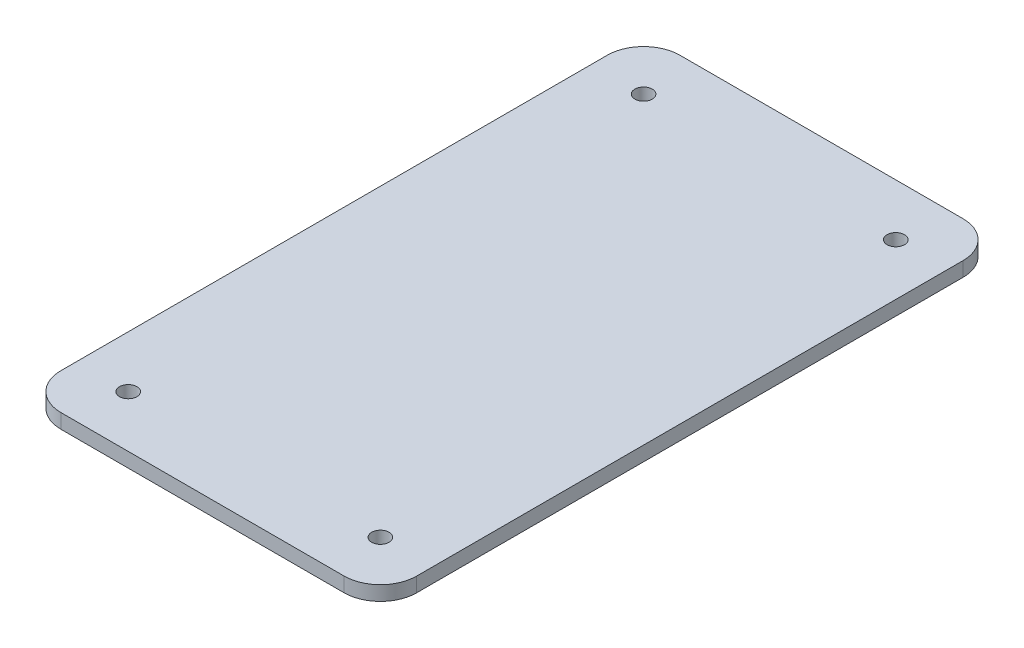
ISO-10303-21;
HEADER;
FILE_DESCRIPTION(('STEP AP214'),'2;1');
FILE_NAME('part.step','',(''),(''),'','','');
FILE_SCHEMA(('AUTOMOTIVE_DESIGN { 1 0 10303 214 1 1 1 1 }'));
ENDSEC;
DATA;
#1=APPLICATION_CONTEXT('core data for automotive mechanical design processes');
#2=APPLICATION_PROTOCOL_DEFINITION('international standard','automotive_design',2000,#1);
#3=PRODUCT_CONTEXT('',#1,'mechanical');
#4=PRODUCT('Part','Part','',(#3));
#5=PRODUCT_RELATED_PRODUCT_CATEGORY('part','',(#4));
#6=PRODUCT_DEFINITION_FORMATION('','',#4);
#7=PRODUCT_DEFINITION_CONTEXT('part definition',#1,'design');
#8=PRODUCT_DEFINITION('design','',#6,#7);
#9=PRODUCT_DEFINITION_SHAPE('','',#8);
#10=(LENGTH_UNIT() NAMED_UNIT(*) SI_UNIT(.MILLI.,.METRE.));
#11=(NAMED_UNIT(*) PLANE_ANGLE_UNIT() SI_UNIT($,.RADIAN.));
#12=(NAMED_UNIT(*) SI_UNIT($,.STERADIAN.) SOLID_ANGLE_UNIT());
#13=UNCERTAINTY_MEASURE_WITH_UNIT(LENGTH_MEASURE(1.E-05),#10,'distance_accuracy_value','');
#14=(GEOMETRIC_REPRESENTATION_CONTEXT(3) GLOBAL_UNCERTAINTY_ASSIGNED_CONTEXT((#13)) GLOBAL_UNIT_ASSIGNED_CONTEXT((#10,
#11,#12)) REPRESENTATION_CONTEXT('',''));
#15=CARTESIAN_POINT('',(0.,0.,0.));
#16=DIRECTION('',(0.,0.,1.));
#17=DIRECTION('',(1.,0.,0.));
#18=AXIS2_PLACEMENT_3D('',#15,#16,#17);
#19=CARTESIAN_POINT('',(-24.892,2.032,43.307));
#20=DIRECTION('',(1.,0.,0.));
#21=DIRECTION('',(0.,0.,-1.));
#22=AXIS2_PLACEMENT_3D('',#19,#20,#21);
#23=PLANE('',#22);
#24=DIRECTION('',(0.,0.,1.));
#25=VECTOR('',#24,1.);
#26=CARTESIAN_POINT('',(-24.892,2.032,43.307));
#27=LINE('',#26,#25);
#28=CARTESIAN_POINT('',(-24.892,2.032,-38.227));
#29=VERTEX_POINT('',#28);
#30=CARTESIAN_POINT('',(-24.892,2.032,38.227));
#31=VERTEX_POINT('',#30);
#32=EDGE_CURVE('E127',#29,#31,#27,.T.);
#33=ORIENTED_EDGE('',*,*,#32,.F.);
#34=DIRECTION('',(0.,-1.,0.));
#35=VECTOR('',#34,1.);
#36=CARTESIAN_POINT('',(-24.892,2.032,-38.227));
#37=LINE('',#36,#35);
#38=CARTESIAN_POINT('',(-24.892,0.,-38.227));
#39=VERTEX_POINT('',#38);
#40=EDGE_CURVE('E153',#29,#39,#37,.T.);
#41=ORIENTED_EDGE('',*,*,#40,.T.);
#42=DIRECTION('',(0.,0.,1.));
#43=VECTOR('',#42,1.);
#44=CARTESIAN_POINT('',(-24.892,0.,43.307));
#45=LINE('',#44,#43);
#46=CARTESIAN_POINT('',(-24.892,0.,38.227));
#47=VERTEX_POINT('',#46);
#48=EDGE_CURVE('E159',#39,#47,#45,.T.);
#49=ORIENTED_EDGE('',*,*,#48,.T.);
#50=DIRECTION('',(0.,-1.,0.));
#51=VECTOR('',#50,1.);
#52=CARTESIAN_POINT('',(-24.892,2.032,38.227));
#53=LINE('',#52,#51);
#54=EDGE_CURVE('E151',#47,#31,#53,.F.);
#55=ORIENTED_EDGE('',*,*,#54,.T.);
#56=EDGE_LOOP('',(#33,#41,#49,#55));
#57=FACE_BOUND('',#56,.T.);
#58=ADVANCED_FACE('F35',(#57),#23,.F.);
#59=CARTESIAN_POINT('',(24.892,2.032,43.307));
#60=DIRECTION('',(0.,0.,-1.));
#61=DIRECTION('',(-1.,0.,0.));
#62=AXIS2_PLACEMENT_3D('',#59,#60,#61);
#63=PLANE('',#62);
#64=DIRECTION('',(1.,0.,0.));
#65=VECTOR('',#64,1.);
#66=CARTESIAN_POINT('',(24.892,2.032,43.307));
#67=LINE('',#66,#65);
#68=CARTESIAN_POINT('',(-19.812,2.032,43.307));
#69=VERTEX_POINT('',#68);
#70=CARTESIAN_POINT('',(19.812,2.032,43.307));
#71=VERTEX_POINT('',#70);
#72=EDGE_CURVE('E130',#69,#71,#67,.T.);
#73=ORIENTED_EDGE('',*,*,#72,.F.);
#74=DIRECTION('',(0.,-1.,0.));
#75=VECTOR('',#74,1.);
#76=CARTESIAN_POINT('',(-19.812,2.032,43.307));
#77=LINE('',#76,#75);
#78=CARTESIAN_POINT('',(-19.812,0.,43.307));
#79=VERTEX_POINT('',#78);
#80=EDGE_CURVE('E11',#69,#79,#77,.T.);
#81=ORIENTED_EDGE('',*,*,#80,.T.);
#82=DIRECTION('',(1.,0.,0.));
#83=VECTOR('',#82,1.);
#84=CARTESIAN_POINT('',(24.892,0.,43.307));
#85=LINE('',#84,#83);
#86=CARTESIAN_POINT('',(19.812,0.,43.307));
#87=VERTEX_POINT('',#86);
#88=EDGE_CURVE('E132',#79,#87,#85,.T.);
#89=ORIENTED_EDGE('',*,*,#88,.T.);
#90=DIRECTION('',(0.,-1.,0.));
#91=VECTOR('',#90,1.);
#92=CARTESIAN_POINT('',(19.812,2.032,43.307));
#93=LINE('',#92,#91);
#94=EDGE_CURVE('E43',#87,#71,#93,.F.);
#95=ORIENTED_EDGE('',*,*,#94,.T.);
#96=EDGE_LOOP('',(#73,#81,#89,#95));
#97=FACE_BOUND('',#96,.T.);
#98=ADVANCED_FACE('F225',(#97),#63,.F.);
#99=CARTESIAN_POINT('',(24.892,2.032,43.307));
#100=DIRECTION('',(-1.,0.,0.));
#101=DIRECTION('',(0.,0.,1.));
#102=AXIS2_PLACEMENT_3D('',#99,#100,#101);
#103=PLANE('',#102);
#104=DIRECTION('',(0.,0.,-1.));
#105=VECTOR('',#104,1.);
#106=CARTESIAN_POINT('',(24.892,0.,43.307));
#107=LINE('',#106,#105);
#108=CARTESIAN_POINT('',(24.892,0.,38.227));
#109=VERTEX_POINT('',#108);
#110=CARTESIAN_POINT('',(24.892,0.,-38.227));
#111=VERTEX_POINT('',#110);
#112=EDGE_CURVE('E128',#109,#111,#107,.T.);
#113=ORIENTED_EDGE('',*,*,#112,.T.);
#114=DIRECTION('',(0.,-1.,0.));
#115=VECTOR('',#114,1.);
#116=CARTESIAN_POINT('',(24.892,2.032,-38.227));
#117=LINE('',#116,#115);
#118=CARTESIAN_POINT('',(24.892,2.032,-38.227));
#119=VERTEX_POINT('',#118);
#120=EDGE_CURVE('E106',#111,#119,#117,.F.);
#121=ORIENTED_EDGE('',*,*,#120,.T.);
#122=DIRECTION('',(0.,0.,-1.));
#123=VECTOR('',#122,1.);
#124=CARTESIAN_POINT('',(24.892,2.032,43.307));
#125=LINE('',#124,#123);
#126=CARTESIAN_POINT('',(24.892,2.032,38.227));
#127=VERTEX_POINT('',#126);
#128=EDGE_CURVE('E171',#127,#119,#125,.T.);
#129=ORIENTED_EDGE('',*,*,#128,.F.);
#130=DIRECTION('',(0.,-1.,0.));
#131=VECTOR('',#130,1.);
#132=CARTESIAN_POINT('',(24.892,2.032,38.227));
#133=LINE('',#132,#131);
#134=EDGE_CURVE('E111',#127,#109,#133,.T.);
#135=ORIENTED_EDGE('',*,*,#134,.T.);
#136=EDGE_LOOP('',(#113,#121,#129,#135));
#137=FACE_BOUND('',#136,.T.);
#138=ADVANCED_FACE('F230',(#137),#103,.F.);
#139=CARTESIAN_POINT('',(24.892,2.032,-43.307));
#140=DIRECTION('',(0.,0.,1.));
#141=DIRECTION('',(1.,0.,0.));
#142=AXIS2_PLACEMENT_3D('',#139,#140,#141);
#143=PLANE('',#142);
#144=DIRECTION('',(-1.,0.,0.));
#145=VECTOR('',#144,1.);
#146=CARTESIAN_POINT('',(24.892,2.032,-43.307));
#147=LINE('',#146,#145);
#148=CARTESIAN_POINT('',(19.812,2.032,-43.307));
#149=VERTEX_POINT('',#148);
#150=CARTESIAN_POINT('',(-19.812,2.032,-43.307));
#151=VERTEX_POINT('',#150);
#152=EDGE_CURVE('E121',#149,#151,#147,.T.);
#153=ORIENTED_EDGE('',*,*,#152,.F.);
#154=DIRECTION('',(0.,-1.,0.));
#155=VECTOR('',#154,1.);
#156=CARTESIAN_POINT('',(19.812,2.032,-43.307));
#157=LINE('',#156,#155);
#158=CARTESIAN_POINT('',(19.812,0.,-43.307));
#159=VERTEX_POINT('',#158);
#160=EDGE_CURVE('E105',#149,#159,#157,.T.);
#161=ORIENTED_EDGE('',*,*,#160,.T.);
#162=DIRECTION('',(-1.,0.,0.));
#163=VECTOR('',#162,1.);
#164=CARTESIAN_POINT('',(24.892,0.,-43.307));
#165=LINE('',#164,#163);
#166=CARTESIAN_POINT('',(-19.812,0.,-43.307));
#167=VERTEX_POINT('',#166);
#168=EDGE_CURVE('E118',#159,#167,#165,.T.);
#169=ORIENTED_EDGE('',*,*,#168,.T.);
#170=DIRECTION('',(0.,-1.,0.));
#171=VECTOR('',#170,1.);
#172=CARTESIAN_POINT('',(-19.812,2.032,-43.307));
#173=LINE('',#172,#171);
#174=EDGE_CURVE('E123',#167,#151,#173,.F.);
#175=ORIENTED_EDGE('',*,*,#174,.T.);
#176=EDGE_LOOP('',(#153,#161,#169,#175));
#177=FACE_BOUND('',#176,.T.);
#178=ADVANCED_FACE('F117',(#177),#143,.F.);
#179=CARTESIAN_POINT('',(0.,2.032,0.));
#180=DIRECTION('',(0.,1.,0.));
#181=DIRECTION('',(0.,0.,1.));
#182=AXIS2_PLACEMENT_3D('',#179,#180,#181);
#183=PLANE('',#182);
#184=CARTESIAN_POINT('',(17.653,2.03200000000003,-36.0519557829135));
#185=DIRECTION('',(0.,-1.,0.));
#186=DIRECTION('',(0.,0.,-1.));
#187=AXIS2_PLACEMENT_3D('',#184,#185,#186);
#188=CIRCLE('',#187,1.21919999999992);
#189=CARTESIAN_POINT('',(17.653,2.03200000000003,-37.2711557829134));
#190=VERTEX_POINT('',#189);
#191=EDGE_CURVE('E189',#190,#190,#188,.T.);
#192=ORIENTED_EDGE('',*,*,#191,.T.);
#193=EDGE_LOOP('',(#192));
#194=FACE_BOUND('',#193,.T.);
#195=CARTESIAN_POINT('',(-17.6369557829134,2.03200000000003,-36.0519557829135));
#196=DIRECTION('',(0.,-1.,0.));
#197=DIRECTION('',(0.,0.,-1.));
#198=AXIS2_PLACEMENT_3D('',#195,#196,#197);
#199=CIRCLE('',#198,1.21919999999992);
#200=CARTESIAN_POINT('',(-17.6369557829134,2.03200000000003,-37.2711557829134));
#201=VERTEX_POINT('',#200);
#202=EDGE_CURVE('E183',#201,#201,#199,.T.);
#203=ORIENTED_EDGE('',*,*,#202,.T.);
#204=EDGE_LOOP('',(#203));
#205=FACE_BOUND('',#204,.T.);
#206=CARTESIAN_POINT('',(17.653,2.03200000000003,36.068));
#207=DIRECTION('',(0.,-1.,0.));
#208=DIRECTION('',(0.,0.,-1.));
#209=AXIS2_PLACEMENT_3D('',#206,#207,#208);
#210=CIRCLE('',#209,1.21919999999992);
#211=CARTESIAN_POINT('',(17.653,2.03200000000003,34.8488000000001));
#212=VERTEX_POINT('',#211);
#213=EDGE_CURVE('E177',#212,#212,#210,.T.);
#214=ORIENTED_EDGE('',*,*,#213,.T.);
#215=EDGE_LOOP('',(#214));
#216=FACE_BOUND('',#215,.T.);
#217=CARTESIAN_POINT('',(-17.6369557829134,2.03200000000003,36.068));
#218=DIRECTION('',(0.,-1.,0.));
#219=DIRECTION('',(0.,0.,-1.));
#220=AXIS2_PLACEMENT_3D('',#217,#218,#219);
#221=CIRCLE('',#220,1.21919999999992);
#222=CARTESIAN_POINT('',(-17.6369557829134,2.03200000000003,34.8488000000001));
#223=VERTEX_POINT('',#222);
#224=EDGE_CURVE('E164',#223,#223,#221,.T.);
#225=ORIENTED_EDGE('',*,*,#224,.T.);
#226=EDGE_LOOP('',(#225));
#227=FACE_BOUND('',#226,.T.);
#228=ORIENTED_EDGE('',*,*,#128,.T.);
#229=CARTESIAN_POINT('',(19.812,2.032,-38.227));
#230=DIRECTION('',(0.,1.,0.));
#231=DIRECTION('',(0.,0.,1.));
#232=AXIS2_PLACEMENT_3D('',#229,#230,#231);
#233=CIRCLE('',#232,5.08);
#234=EDGE_CURVE('E149',#119,#149,#233,.T.);
#235=ORIENTED_EDGE('',*,*,#234,.T.);
#236=ORIENTED_EDGE('',*,*,#152,.T.);
#237=CARTESIAN_POINT('',(-19.812,2.032,-38.227));
#238=DIRECTION('',(0.,1.,0.));
#239=DIRECTION('',(0.,0.,1.));
#240=AXIS2_PLACEMENT_3D('',#237,#238,#239);
#241=CIRCLE('',#240,5.08);
#242=EDGE_CURVE('E147',#151,#29,#241,.T.);
#243=ORIENTED_EDGE('',*,*,#242,.T.);
#244=ORIENTED_EDGE('',*,*,#32,.T.);
#245=CARTESIAN_POINT('',(-19.812,2.032,38.227));
#246=DIRECTION('',(0.,1.,0.));
#247=DIRECTION('',(0.,0.,1.));
#248=AXIS2_PLACEMENT_3D('',#245,#246,#247);
#249=CIRCLE('',#248,5.08);
#250=EDGE_CURVE('E56',#31,#69,#249,.T.);
#251=ORIENTED_EDGE('',*,*,#250,.T.);
#252=ORIENTED_EDGE('',*,*,#72,.T.);
#253=CARTESIAN_POINT('',(19.812,2.032,38.227));
#254=DIRECTION('',(0.,1.,0.));
#255=DIRECTION('',(0.,0.,1.));
#256=AXIS2_PLACEMENT_3D('',#253,#254,#255);
#257=CIRCLE('',#256,5.08);
#258=EDGE_CURVE('E144',#71,#127,#257,.T.);
#259=ORIENTED_EDGE('',*,*,#258,.T.);
#260=EDGE_LOOP('',(#228,#235,#236,#243,#244,#251,#252,#259));
#261=FACE_BOUND('',#260,.T.);
#262=ADVANCED_FACE('F200',(#194,#205,#216,#227,#261),#183,.T.);
#263=CARTESIAN_POINT('',(0.,0.,0.));
#264=DIRECTION('',(0.,1.,0.));
#265=DIRECTION('',(0.,0.,1.));
#266=AXIS2_PLACEMENT_3D('',#263,#264,#265);
#267=PLANE('',#266);
#268=CARTESIAN_POINT('',(17.653,0.,-36.0519557829135));
#269=DIRECTION('',(0.,-1.,0.));
#270=DIRECTION('',(0.,0.,-1.));
#271=AXIS2_PLACEMENT_3D('',#268,#269,#270);
#272=CIRCLE('',#271,1.21919999999992);
#273=CARTESIAN_POINT('',(17.653,0.,-37.2711557829134));
#274=VERTEX_POINT('',#273);
#275=EDGE_CURVE('E192',#274,#274,#272,.T.);
#276=ORIENTED_EDGE('',*,*,#275,.F.);
#277=EDGE_LOOP('',(#276));
#278=FACE_BOUND('',#277,.T.);
#279=CARTESIAN_POINT('',(-17.6369557829134,0.,-36.0519557829135));
#280=DIRECTION('',(0.,-1.,0.));
#281=DIRECTION('',(0.,0.,-1.));
#282=AXIS2_PLACEMENT_3D('',#279,#280,#281);
#283=CIRCLE('',#282,1.21919999999992);
#284=CARTESIAN_POINT('',(-17.6369557829134,0.,-37.2711557829134));
#285=VERTEX_POINT('',#284);
#286=EDGE_CURVE('E186',#285,#285,#283,.T.);
#287=ORIENTED_EDGE('',*,*,#286,.F.);
#288=EDGE_LOOP('',(#287));
#289=FACE_BOUND('',#288,.T.);
#290=CARTESIAN_POINT('',(17.653,0.,36.068));
#291=DIRECTION('',(0.,-1.,0.));
#292=DIRECTION('',(0.,0.,-1.));
#293=AXIS2_PLACEMENT_3D('',#290,#291,#292);
#294=CIRCLE('',#293,1.21919999999992);
#295=CARTESIAN_POINT('',(17.653,0.,34.8488000000001));
#296=VERTEX_POINT('',#295);
#297=EDGE_CURVE('E180',#296,#296,#294,.T.);
#298=ORIENTED_EDGE('',*,*,#297,.F.);
#299=EDGE_LOOP('',(#298));
#300=FACE_BOUND('',#299,.T.);
#301=CARTESIAN_POINT('',(-17.6369557829134,0.,36.068));
#302=DIRECTION('',(0.,-1.,0.));
#303=DIRECTION('',(0.,0.,-1.));
#304=AXIS2_PLACEMENT_3D('',#301,#302,#303);
#305=CIRCLE('',#304,1.21919999999992);
#306=CARTESIAN_POINT('',(-17.6369557829134,0.,34.8488000000001));
#307=VERTEX_POINT('',#306);
#308=EDGE_CURVE('E167',#307,#307,#305,.T.);
#309=ORIENTED_EDGE('',*,*,#308,.F.);
#310=EDGE_LOOP('',(#309));
#311=FACE_BOUND('',#310,.T.);
#312=ORIENTED_EDGE('',*,*,#168,.F.);
#313=CARTESIAN_POINT('',(19.812,0.,-38.227));
#314=DIRECTION('',(0.,1.,0.));
#315=DIRECTION('',(0.,0.,1.));
#316=AXIS2_PLACEMENT_3D('',#313,#314,#315);
#317=CIRCLE('',#316,5.08);
#318=EDGE_CURVE('E101',#159,#111,#317,.F.);
#319=ORIENTED_EDGE('',*,*,#318,.T.);
#320=ORIENTED_EDGE('',*,*,#112,.F.);
#321=CARTESIAN_POINT('',(19.812,0.,38.227));
#322=DIRECTION('',(0.,1.,0.));
#323=DIRECTION('',(0.,0.,1.));
#324=AXIS2_PLACEMENT_3D('',#321,#322,#323);
#325=CIRCLE('',#324,5.08);
#326=EDGE_CURVE('E122',#109,#87,#325,.F.);
#327=ORIENTED_EDGE('',*,*,#326,.T.);
#328=ORIENTED_EDGE('',*,*,#88,.F.);
#329=CARTESIAN_POINT('',(-19.812,0.,38.227));
#330=DIRECTION('',(0.,1.,0.));
#331=DIRECTION('',(0.,0.,1.));
#332=AXIS2_PLACEMENT_3D('',#329,#330,#331);
#333=CIRCLE('',#332,5.08);
#334=EDGE_CURVE('E138',#79,#47,#333,.F.);
#335=ORIENTED_EDGE('',*,*,#334,.T.);
#336=ORIENTED_EDGE('',*,*,#48,.F.);
#337=CARTESIAN_POINT('',(-19.812,0.,-38.227));
#338=DIRECTION('',(0.,1.,0.));
#339=DIRECTION('',(0.,0.,1.));
#340=AXIS2_PLACEMENT_3D('',#337,#338,#339);
#341=CIRCLE('',#340,5.08);
#342=EDGE_CURVE('E112',#39,#167,#341,.F.);
#343=ORIENTED_EDGE('',*,*,#342,.T.);
#344=EDGE_LOOP('',(#312,#319,#320,#327,#328,#335,#336,#343));
#345=FACE_BOUND('',#344,.T.);
#346=ADVANCED_FACE('F125',(#278,#289,#300,#311,#345),#267,.F.);
#347=CARTESIAN_POINT('',(19.812,2.032,-38.227));
#348=DIRECTION('',(0.,-1.,0.));
#349=DIRECTION('',(0.,0.,-1.));
#350=AXIS2_PLACEMENT_3D('',#347,#348,#349);
#351=CYLINDRICAL_SURFACE('',#350,5.08);
#352=ORIENTED_EDGE('',*,*,#234,.F.);
#353=ORIENTED_EDGE('',*,*,#120,.F.);
#354=ORIENTED_EDGE('',*,*,#318,.F.);
#355=ORIENTED_EDGE('',*,*,#160,.F.);
#356=EDGE_LOOP('',(#352,#353,#354,#355));
#357=FACE_BOUND('',#356,.T.);
#358=ADVANCED_FACE('F104',(#357),#351,.T.);
#359=CARTESIAN_POINT('',(-19.812,2.032,-38.227));
#360=DIRECTION('',(0.,-1.,0.));
#361=DIRECTION('',(0.,0.,-1.));
#362=AXIS2_PLACEMENT_3D('',#359,#360,#361);
#363=CYLINDRICAL_SURFACE('',#362,5.08);
#364=ORIENTED_EDGE('',*,*,#242,.F.);
#365=ORIENTED_EDGE('',*,*,#174,.F.);
#366=ORIENTED_EDGE('',*,*,#342,.F.);
#367=ORIENTED_EDGE('',*,*,#40,.F.);
#368=EDGE_LOOP('',(#364,#365,#366,#367));
#369=FACE_BOUND('',#368,.T.);
#370=ADVANCED_FACE('F236',(#369),#363,.T.);
#371=CARTESIAN_POINT('',(-19.812,2.032,38.227));
#372=DIRECTION('',(0.,-1.,0.));
#373=DIRECTION('',(0.,0.,-1.));
#374=AXIS2_PLACEMENT_3D('',#371,#372,#373);
#375=CYLINDRICAL_SURFACE('',#374,5.08);
#376=ORIENTED_EDGE('',*,*,#250,.F.);
#377=ORIENTED_EDGE('',*,*,#54,.F.);
#378=ORIENTED_EDGE('',*,*,#334,.F.);
#379=ORIENTED_EDGE('',*,*,#80,.F.);
#380=EDGE_LOOP('',(#376,#377,#378,#379));
#381=FACE_BOUND('',#380,.T.);
#382=ADVANCED_FACE('F220',(#381),#375,.T.);
#383=CARTESIAN_POINT('',(19.812,2.032,38.227));
#384=DIRECTION('',(0.,-1.,0.));
#385=DIRECTION('',(0.,0.,-1.));
#386=AXIS2_PLACEMENT_3D('',#383,#384,#385);
#387=CYLINDRICAL_SURFACE('',#386,5.08);
#388=ORIENTED_EDGE('',*,*,#258,.F.);
#389=ORIENTED_EDGE('',*,*,#94,.F.);
#390=ORIENTED_EDGE('',*,*,#326,.F.);
#391=ORIENTED_EDGE('',*,*,#134,.F.);
#392=EDGE_LOOP('',(#388,#389,#390,#391));
#393=FACE_BOUND('',#392,.T.);
#394=ADVANCED_FACE('F37',(#393),#387,.T.);
#395=CARTESIAN_POINT('',(-17.6369557829134,0.,36.068));
#396=DIRECTION('',(0.,-1.,0.));
#397=DIRECTION('',(0.,0.,-1.));
#398=AXIS2_PLACEMENT_3D('',#395,#396,#397);
#399=CYLINDRICAL_SURFACE('',#398,1.21919999999992);
#400=ORIENTED_EDGE('',*,*,#224,.F.);
#401=EDGE_LOOP('',(#400));
#402=FACE_BOUND('',#401,.T.);
#403=ORIENTED_EDGE('',*,*,#308,.T.);
#404=EDGE_LOOP('',(#403));
#405=FACE_BOUND('',#404,.T.);
#406=ADVANCED_FACE('F208',(#402,#405),#399,.F.);
#407=CARTESIAN_POINT('',(17.653,0.,36.068));
#408=DIRECTION('',(0.,-1.,0.));
#409=DIRECTION('',(0.,0.,-1.));
#410=AXIS2_PLACEMENT_3D('',#407,#408,#409);
#411=CYLINDRICAL_SURFACE('',#410,1.21919999999992);
#412=ORIENTED_EDGE('',*,*,#213,.F.);
#413=EDGE_LOOP('',(#412));
#414=FACE_BOUND('',#413,.T.);
#415=ORIENTED_EDGE('',*,*,#297,.T.);
#416=EDGE_LOOP('',(#415));
#417=FACE_BOUND('',#416,.T.);
#418=ADVANCED_FACE('F210',(#414,#417),#411,.F.);
#419=CARTESIAN_POINT('',(-17.6369557829134,0.,-36.0519557829135));
#420=DIRECTION('',(0.,-1.,0.));
#421=DIRECTION('',(0.,0.,-1.));
#422=AXIS2_PLACEMENT_3D('',#419,#420,#421);
#423=CYLINDRICAL_SURFACE('',#422,1.21919999999992);
#424=ORIENTED_EDGE('',*,*,#202,.F.);
#425=EDGE_LOOP('',(#424));
#426=FACE_BOUND('',#425,.T.);
#427=ORIENTED_EDGE('',*,*,#286,.T.);
#428=EDGE_LOOP('',(#427));
#429=FACE_BOUND('',#428,.T.);
#430=ADVANCED_FACE('F217',(#426,#429),#423,.F.);
#431=CARTESIAN_POINT('',(17.653,0.,-36.0519557829135));
#432=DIRECTION('',(0.,-1.,0.));
#433=DIRECTION('',(0.,0.,-1.));
#434=AXIS2_PLACEMENT_3D('',#431,#432,#433);
#435=CYLINDRICAL_SURFACE('',#434,1.21919999999992);
#436=ORIENTED_EDGE('',*,*,#191,.F.);
#437=EDGE_LOOP('',(#436));
#438=FACE_BOUND('',#437,.T.);
#439=ORIENTED_EDGE('',*,*,#275,.T.);
#440=EDGE_LOOP('',(#439));
#441=FACE_BOUND('',#440,.T.);
#442=ADVANCED_FACE('F196',(#438,#441),#435,.F.);
#443=CLOSED_SHELL('',(#58,#98,#138,#178,#262,#346,#358,#370,#382,#394,#406,#418,#430,#442));
#444=MANIFOLD_SOLID_BREP('B2',#443);
#445=ADVANCED_BREP_SHAPE_REPRESENTATION('',(#18,#444),#14);
#446=SHAPE_DEFINITION_REPRESENTATION(#9,#445);
ENDSEC;
END-ISO-10303-21;
